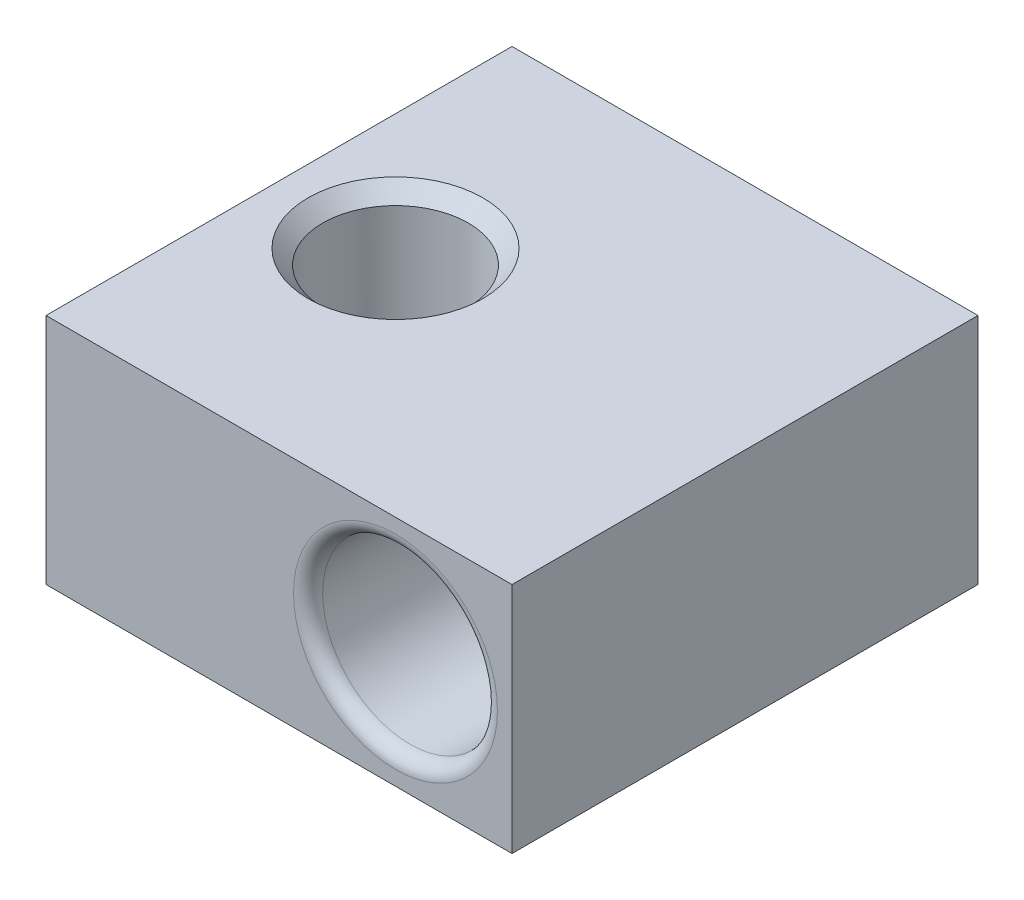
ISO-10303-21;
HEADER;
FILE_DESCRIPTION(('STEP AP214'),'2;1');
FILE_NAME('part.step','',(''),(''),'','','');
FILE_SCHEMA(('AUTOMOTIVE_DESIGN { 1 0 10303 214 1 1 1 1 }'));
ENDSEC;
DATA;
#1=APPLICATION_CONTEXT('core data for automotive mechanical design processes');
#2=APPLICATION_PROTOCOL_DEFINITION('international standard','automotive_design',2000,#1);
#3=PRODUCT_CONTEXT('',#1,'mechanical');
#4=PRODUCT('Part','Part','',(#3));
#5=PRODUCT_RELATED_PRODUCT_CATEGORY('part','',(#4));
#6=PRODUCT_DEFINITION_FORMATION('','',#4);
#7=PRODUCT_DEFINITION_CONTEXT('part definition',#1,'design');
#8=PRODUCT_DEFINITION('design','',#6,#7);
#9=PRODUCT_DEFINITION_SHAPE('','',#8);
#10=(LENGTH_UNIT() NAMED_UNIT(*) SI_UNIT(.MILLI.,.METRE.));
#11=(NAMED_UNIT(*) PLANE_ANGLE_UNIT() SI_UNIT($,.RADIAN.));
#12=(NAMED_UNIT(*) SI_UNIT($,.STERADIAN.) SOLID_ANGLE_UNIT());
#13=UNCERTAINTY_MEASURE_WITH_UNIT(LENGTH_MEASURE(1.E-05),#10,'distance_accuracy_value','');
#14=(GEOMETRIC_REPRESENTATION_CONTEXT(3) GLOBAL_UNCERTAINTY_ASSIGNED_CONTEXT((#13)) GLOBAL_UNIT_ASSIGNED_CONTEXT((#10,
#11,#12)) REPRESENTATION_CONTEXT('',''));
#15=CARTESIAN_POINT('',(0.,0.,0.));
#16=DIRECTION('',(0.,0.,1.));
#17=DIRECTION('',(1.,0.,0.));
#18=AXIS2_PLACEMENT_3D('',#15,#16,#17);
#19=CARTESIAN_POINT('',(0.,0.,16.));
#20=DIRECTION('',(0.,0.,-1.));
#21=DIRECTION('',(-1.,0.,0.));
#22=AXIS2_PLACEMENT_3D('',#19,#20,#21);
#23=PLANE('',#22);
#24=CARTESIAN_POINT('',(12.,4.,16.));
#25=DIRECTION('',(0.,0.,-1.));
#26=DIRECTION('',(-1.,0.,0.));
#27=AXIS2_PLACEMENT_3D('',#24,#25,#26);
#28=CIRCLE('',#27,3.5);
#29=CARTESIAN_POINT('',(8.5,4.,16.));
#30=VERTEX_POINT('',#29);
#31=EDGE_CURVE('E11',#30,#30,#28,.T.);
#32=ORIENTED_EDGE('',*,*,#31,.T.);
#33=EDGE_LOOP('',(#32));
#34=FACE_BOUND('',#33,.T.);
#35=DIRECTION('',(0.,-1.,0.));
#36=VECTOR('',#35,1.);
#37=CARTESIAN_POINT('',(0.,0.,16.));
#38=LINE('',#37,#36);
#39=CARTESIAN_POINT('',(0.,8.,16.));
#40=VERTEX_POINT('',#39);
#41=CARTESIAN_POINT('',(0.,0.,16.));
#42=VERTEX_POINT('',#41);
#43=EDGE_CURVE('E93',#40,#42,#38,.T.);
#44=ORIENTED_EDGE('',*,*,#43,.T.);
#45=DIRECTION('',(1.,0.,0.));
#46=VECTOR('',#45,1.);
#47=CARTESIAN_POINT('',(0.,0.,16.));
#48=LINE('',#47,#46);
#49=CARTESIAN_POINT('',(16.,0.,16.));
#50=VERTEX_POINT('',#49);
#51=EDGE_CURVE('E89',#42,#50,#48,.T.);
#52=ORIENTED_EDGE('',*,*,#51,.T.);
#53=DIRECTION('',(0.,1.,0.));
#54=VECTOR('',#53,1.);
#55=CARTESIAN_POINT('',(16.,0.,16.));
#56=LINE('',#55,#54);
#57=CARTESIAN_POINT('',(16.,8.,16.));
#58=VERTEX_POINT('',#57);
#59=EDGE_CURVE('E91',#50,#58,#56,.T.);
#60=ORIENTED_EDGE('',*,*,#59,.T.);
#61=DIRECTION('',(-1.,0.,0.));
#62=VECTOR('',#61,1.);
#63=CARTESIAN_POINT('',(0.,8.,16.));
#64=LINE('',#63,#62);
#65=EDGE_CURVE('E58',#58,#40,#64,.T.);
#66=ORIENTED_EDGE('',*,*,#65,.T.);
#67=EDGE_LOOP('',(#44,#52,#60,#66));
#68=FACE_BOUND('',#67,.T.);
#69=ADVANCED_FACE('F40',(#34,#68),#23,.F.);
#70=CARTESIAN_POINT('',(0.,0.,0.));
#71=DIRECTION('',(0.,0.,-1.));
#72=DIRECTION('',(-1.,0.,0.));
#73=AXIS2_PLACEMENT_3D('',#70,#71,#72);
#74=PLANE('',#73);
#75=CARTESIAN_POINT('',(12.,4.,0.));
#76=DIRECTION('',(0.,0.,-1.));
#77=DIRECTION('',(-1.,0.,0.));
#78=AXIS2_PLACEMENT_3D('',#75,#76,#77);
#79=CIRCLE('',#78,3.5);
#80=CARTESIAN_POINT('',(8.5,4.,0.));
#81=VERTEX_POINT('',#80);
#82=EDGE_CURVE('E145',#81,#81,#79,.F.);
#83=ORIENTED_EDGE('',*,*,#82,.T.);
#84=EDGE_LOOP('',(#83));
#85=FACE_BOUND('',#84,.T.);
#86=DIRECTION('',(0.,-1.,0.));
#87=VECTOR('',#86,1.);
#88=CARTESIAN_POINT('',(0.,0.,0.));
#89=LINE('',#88,#87);
#90=CARTESIAN_POINT('',(0.,8.,0.));
#91=VERTEX_POINT('',#90);
#92=CARTESIAN_POINT('',(0.,0.,0.));
#93=VERTEX_POINT('',#92);
#94=EDGE_CURVE('E113',#91,#93,#89,.T.);
#95=ORIENTED_EDGE('',*,*,#94,.F.);
#96=DIRECTION('',(-1.,0.,0.));
#97=VECTOR('',#96,1.);
#98=CARTESIAN_POINT('',(0.,8.,0.));
#99=LINE('',#98,#97);
#100=CARTESIAN_POINT('',(16.,8.,0.));
#101=VERTEX_POINT('',#100);
#102=EDGE_CURVE('E81',#101,#91,#99,.T.);
#103=ORIENTED_EDGE('',*,*,#102,.F.);
#104=DIRECTION('',(0.,1.,0.));
#105=VECTOR('',#104,1.);
#106=CARTESIAN_POINT('',(16.,0.,0.));
#107=LINE('',#106,#105);
#108=CARTESIAN_POINT('',(16.,0.,0.));
#109=VERTEX_POINT('',#108);
#110=EDGE_CURVE('E75',#109,#101,#107,.T.);
#111=ORIENTED_EDGE('',*,*,#110,.F.);
#112=DIRECTION('',(1.,0.,0.));
#113=VECTOR('',#112,1.);
#114=CARTESIAN_POINT('',(0.,0.,0.));
#115=LINE('',#114,#113);
#116=EDGE_CURVE('E99',#93,#109,#115,.T.);
#117=ORIENTED_EDGE('',*,*,#116,.F.);
#118=EDGE_LOOP('',(#95,#103,#111,#117));
#119=FACE_BOUND('',#118,.T.);
#120=ADVANCED_FACE('F166',(#85,#119),#74,.T.);
#121=CARTESIAN_POINT('',(0.,0.,16.));
#122=DIRECTION('',(1.,0.,0.));
#123=DIRECTION('',(0.,0.,-1.));
#124=AXIS2_PLACEMENT_3D('',#121,#122,#123);
#125=PLANE('',#124);
#126=ORIENTED_EDGE('',*,*,#94,.T.);
#127=DIRECTION('',(0.,0.,-1.));
#128=VECTOR('',#127,1.);
#129=CARTESIAN_POINT('',(0.,0.,16.));
#130=LINE('',#129,#128);
#131=EDGE_CURVE('E101',#42,#93,#130,.T.);
#132=ORIENTED_EDGE('',*,*,#131,.F.);
#133=ORIENTED_EDGE('',*,*,#43,.F.);
#134=DIRECTION('',(0.,0.,-1.));
#135=VECTOR('',#134,1.);
#136=CARTESIAN_POINT('',(0.,8.,16.));
#137=LINE('',#136,#135);
#138=EDGE_CURVE('E109',#40,#91,#137,.T.);
#139=ORIENTED_EDGE('',*,*,#138,.T.);
#140=EDGE_LOOP('',(#126,#132,#133,#139));
#141=FACE_BOUND('',#140,.T.);
#142=ADVANCED_FACE('F169',(#141),#125,.F.);
#143=CARTESIAN_POINT('',(0.,0.,16.));
#144=DIRECTION('',(0.,1.,0.));
#145=DIRECTION('',(0.,0.,1.));
#146=AXIS2_PLACEMENT_3D('',#143,#144,#145);
#147=PLANE('',#146);
#148=CARTESIAN_POINT('',(4.,0.,8.));
#149=DIRECTION('',(0.,1.,0.));
#150=DIRECTION('',(0.,0.,1.));
#151=AXIS2_PLACEMENT_3D('',#148,#149,#150);
#152=CIRCLE('',#151,3.);
#153=CARTESIAN_POINT('',(4.,0.,11.));
#154=VERTEX_POINT('',#153);
#155=EDGE_CURVE('E129',#154,#154,#152,.T.);
#156=ORIENTED_EDGE('',*,*,#155,.T.);
#157=EDGE_LOOP('',(#156));
#158=FACE_BOUND('',#157,.T.);
#159=ORIENTED_EDGE('',*,*,#116,.T.);
#160=DIRECTION('',(0.,0.,-1.));
#161=VECTOR('',#160,1.);
#162=CARTESIAN_POINT('',(16.,0.,16.));
#163=LINE('',#162,#161);
#164=EDGE_CURVE('E97',#50,#109,#163,.T.);
#165=ORIENTED_EDGE('',*,*,#164,.F.);
#166=ORIENTED_EDGE('',*,*,#51,.F.);
#167=ORIENTED_EDGE('',*,*,#131,.T.);
#168=EDGE_LOOP('',(#159,#165,#166,#167));
#169=FACE_BOUND('',#168,.T.);
#170=ADVANCED_FACE('F98',(#158,#169),#147,.F.);
#171=CARTESIAN_POINT('',(16.,0.,16.));
#172=DIRECTION('',(-1.,0.,0.));
#173=DIRECTION('',(0.,0.,1.));
#174=AXIS2_PLACEMENT_3D('',#171,#172,#173);
#175=PLANE('',#174);
#176=ORIENTED_EDGE('',*,*,#110,.T.);
#177=DIRECTION('',(0.,0.,-1.));
#178=VECTOR('',#177,1.);
#179=CARTESIAN_POINT('',(16.,8.,16.));
#180=LINE('',#179,#178);
#181=EDGE_CURVE('E102',#58,#101,#180,.T.);
#182=ORIENTED_EDGE('',*,*,#181,.F.);
#183=ORIENTED_EDGE('',*,*,#59,.F.);
#184=ORIENTED_EDGE('',*,*,#164,.T.);
#185=EDGE_LOOP('',(#176,#182,#183,#184));
#186=FACE_BOUND('',#185,.T.);
#187=ADVANCED_FACE('F104',(#186),#175,.F.);
#188=CARTESIAN_POINT('',(0.,8.,16.));
#189=DIRECTION('',(0.,-1.,0.));
#190=DIRECTION('',(0.,0.,-1.));
#191=AXIS2_PLACEMENT_3D('',#188,#189,#190);
#192=PLANE('',#191);
#193=CARTESIAN_POINT('',(4.,8.,8.));
#194=DIRECTION('',(0.,-1.,0.));
#195=DIRECTION('',(0.,0.,-1.));
#196=AXIS2_PLACEMENT_3D('',#193,#194,#195);
#197=CIRCLE('',#196,3.);
#198=CARTESIAN_POINT('',(4.,8.,5.));
#199=VERTEX_POINT('',#198);
#200=EDGE_CURVE('E141',#199,#199,#197,.T.);
#201=ORIENTED_EDGE('',*,*,#200,.T.);
#202=EDGE_LOOP('',(#201));
#203=FACE_BOUND('',#202,.T.);
#204=ORIENTED_EDGE('',*,*,#102,.T.);
#205=ORIENTED_EDGE('',*,*,#138,.F.);
#206=ORIENTED_EDGE('',*,*,#65,.F.);
#207=ORIENTED_EDGE('',*,*,#181,.T.);
#208=EDGE_LOOP('',(#204,#205,#206,#207));
#209=FACE_BOUND('',#208,.T.);
#210=ADVANCED_FACE('F173',(#203,#209),#192,.F.);
#211=CARTESIAN_POINT('',(12.,4.,16.));
#212=DIRECTION('',(0.,0.,-1.));
#213=DIRECTION('',(-1.,0.,0.));
#214=AXIS2_PLACEMENT_3D('',#211,#212,#213);
#215=CYLINDRICAL_SURFACE('',#214,3.);
#216=CARTESIAN_POINT('',(12.,4.,0.5));
#217=DIRECTION('',(0.,0.,-1.));
#218=DIRECTION('',(-1.,0.,0.));
#219=AXIS2_PLACEMENT_3D('',#216,#217,#218);
#220=CIRCLE('',#219,3.);
#221=CARTESIAN_POINT('',(9.,4.,0.5));
#222=VERTEX_POINT('',#221);
#223=EDGE_CURVE('E50',#222,#222,#220,.T.);
#224=ORIENTED_EDGE('',*,*,#223,.T.);
#225=EDGE_LOOP('',(#224));
#226=FACE_BOUND('',#225,.T.);
#227=CARTESIAN_POINT('',(12.,4.,15.5));
#228=DIRECTION('',(0.,0.,-1.));
#229=DIRECTION('',(-1.,0.,0.));
#230=AXIS2_PLACEMENT_3D('',#227,#228,#229);
#231=CIRCLE('',#230,3.);
#232=CARTESIAN_POINT('',(9.,4.,15.5));
#233=VERTEX_POINT('',#232);
#234=EDGE_CURVE('E149',#233,#233,#231,.F.);
#235=ORIENTED_EDGE('',*,*,#234,.T.);
#236=EDGE_LOOP('',(#235));
#237=FACE_BOUND('',#236,.T.);
#238=ADVANCED_FACE('F157',(#226,#237),#215,.F.);
#239=CARTESIAN_POINT('',(4.,0.,8.));
#240=DIRECTION('',(0.,1.,0.));
#241=DIRECTION('',(0.,0.,1.));
#242=AXIS2_PLACEMENT_3D('',#239,#240,#241);
#243=CYLINDRICAL_SURFACE('',#242,2.5);
#244=CARTESIAN_POINT('',(4.,0.5,8.));
#245=DIRECTION('',(0.,1.,0.));
#246=DIRECTION('',(0.,0.,1.));
#247=AXIS2_PLACEMENT_3D('',#244,#245,#246);
#248=CIRCLE('',#247,2.5);
#249=CARTESIAN_POINT('',(4.,0.5,10.5));
#250=VERTEX_POINT('',#249);
#251=EDGE_CURVE('E137',#250,#250,#248,.F.);
#252=ORIENTED_EDGE('',*,*,#251,.T.);
#253=EDGE_LOOP('',(#252));
#254=FACE_BOUND('',#253,.T.);
#255=CARTESIAN_POINT('',(4.,7.5,8.));
#256=DIRECTION('',(0.,-1.,0.));
#257=DIRECTION('',(0.,0.,-1.));
#258=AXIS2_PLACEMENT_3D('',#255,#256,#257);
#259=CIRCLE('',#258,2.5);
#260=CARTESIAN_POINT('',(4.,7.5,5.5));
#261=VERTEX_POINT('',#260);
#262=EDGE_CURVE('E133',#261,#261,#259,.F.);
#263=ORIENTED_EDGE('',*,*,#262,.T.);
#264=EDGE_LOOP('',(#263));
#265=FACE_BOUND('',#264,.T.);
#266=ADVANCED_FACE('F181',(#254,#265),#243,.F.);
#267=CARTESIAN_POINT('',(4.,0.,8.));
#268=DIRECTION('',(0.,-1.,0.));
#269=DIRECTION('',(0.,0.,-1.));
#270=AXIS2_PLACEMENT_3D('',#267,#268,#269);
#271=CONICAL_SURFACE('',#270,3.,0.785398163397445);
#272=ORIENTED_EDGE('',*,*,#251,.F.);
#273=EDGE_LOOP('',(#272));
#274=FACE_BOUND('',#273,.T.);
#275=ORIENTED_EDGE('',*,*,#155,.F.);
#276=EDGE_LOOP('',(#275));
#277=FACE_BOUND('',#276,.T.);
#278=ADVANCED_FACE('F191',(#274,#277),#271,.F.);
#279=CARTESIAN_POINT('',(4.,7.5,8.));
#280=DIRECTION('',(0.,1.,0.));
#281=DIRECTION('',(0.,0.,1.));
#282=AXIS2_PLACEMENT_3D('',#279,#280,#281);
#283=CONICAL_SURFACE('',#282,2.5,0.78539816339745);
#284=ORIENTED_EDGE('',*,*,#200,.F.);
#285=EDGE_LOOP('',(#284));
#286=FACE_BOUND('',#285,.T.);
#287=ORIENTED_EDGE('',*,*,#262,.F.);
#288=EDGE_LOOP('',(#287));
#289=FACE_BOUND('',#288,.T.);
#290=ADVANCED_FACE('F163',(#286,#289),#283,.F.);
#291=CARTESIAN_POINT('',(12.,4.,0.5));
#292=DIRECTION('',(0.,0.,-1.));
#293=DIRECTION('',(-1.,0.,0.));
#294=AXIS2_PLACEMENT_3D('',#291,#292,#293);
#295=TOROIDAL_SURFACE('',#294,3.5,0.5);
#296=ORIENTED_EDGE('',*,*,#223,.F.);
#297=EDGE_LOOP('',(#296));
#298=FACE_BOUND('',#297,.T.);
#299=ORIENTED_EDGE('',*,*,#82,.F.);
#300=EDGE_LOOP('',(#299));
#301=FACE_BOUND('',#300,.T.);
#302=ADVANCED_FACE('F160',(#298,#301),#295,.T.);
#303=CARTESIAN_POINT('',(12.,4.,15.5));
#304=DIRECTION('',(0.,0.,-1.));
#305=DIRECTION('',(-1.,0.,0.));
#306=AXIS2_PLACEMENT_3D('',#303,#304,#305);
#307=TOROIDAL_SURFACE('',#306,3.5,0.5);
#308=ORIENTED_EDGE('',*,*,#31,.F.);
#309=EDGE_LOOP('',(#308));
#310=FACE_BOUND('',#309,.T.);
#311=ORIENTED_EDGE('',*,*,#234,.F.);
#312=EDGE_LOOP('',(#311));
#313=FACE_BOUND('',#312,.T.);
#314=ADVANCED_FACE('F42',(#310,#313),#307,.T.);
#315=CLOSED_SHELL('',(#69,#120,#142,#170,#187,#210,#238,#266,#278,#290,#302,#314));
#316=MANIFOLD_SOLID_BREP('B2',#315);
#317=ADVANCED_BREP_SHAPE_REPRESENTATION('',(#18,#316),#14);
#318=SHAPE_DEFINITION_REPRESENTATION(#9,#317);
ENDSEC;
END-ISO-10303-21;
